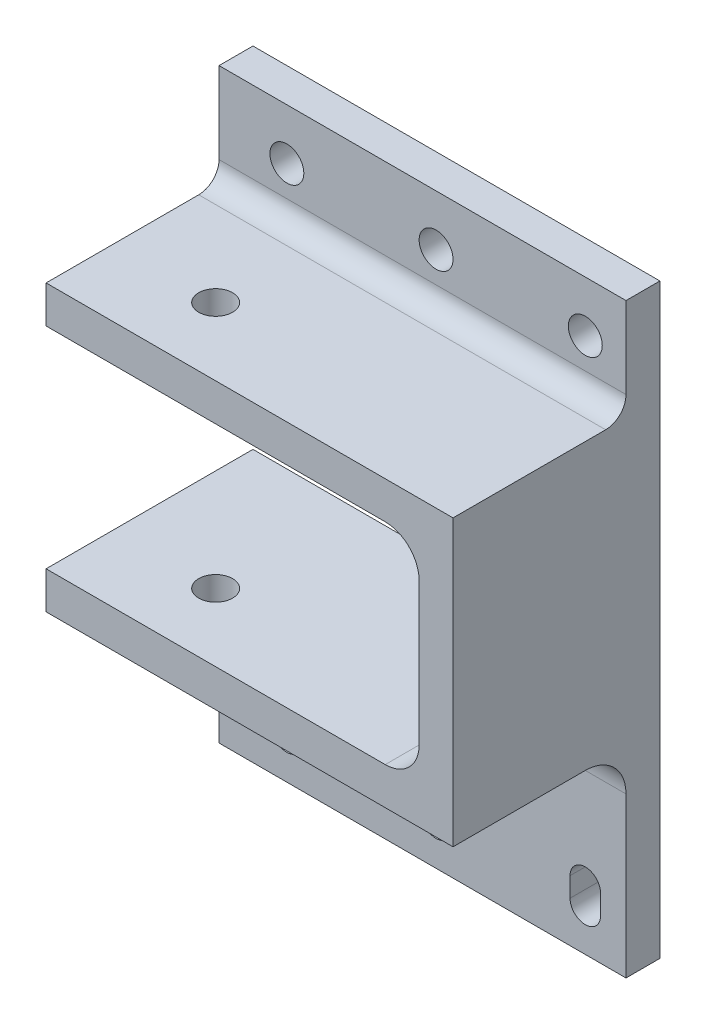
ISO-10303-21;
HEADER;
FILE_DESCRIPTION(('STEP AP214'),'2;1');
FILE_NAME('part.step','',(''),(''),'','','');
FILE_SCHEMA(('AUTOMOTIVE_DESIGN { 1 0 10303 214 1 1 1 1 }'));
ENDSEC;
DATA;
#1=APPLICATION_CONTEXT('core data for automotive mechanical design processes');
#2=APPLICATION_PROTOCOL_DEFINITION('international standard','automotive_design',2000,#1);
#3=PRODUCT_CONTEXT('',#1,'mechanical');
#4=PRODUCT('Part','Part','',(#3));
#5=PRODUCT_RELATED_PRODUCT_CATEGORY('part','',(#4));
#6=PRODUCT_DEFINITION_FORMATION('','',#4);
#7=PRODUCT_DEFINITION_CONTEXT('part definition',#1,'design');
#8=PRODUCT_DEFINITION('design','',#6,#7);
#9=PRODUCT_DEFINITION_SHAPE('','',#8);
#10=(LENGTH_UNIT() NAMED_UNIT(*) SI_UNIT(.MILLI.,.METRE.));
#11=(NAMED_UNIT(*) PLANE_ANGLE_UNIT() SI_UNIT($,.RADIAN.));
#12=(NAMED_UNIT(*) SI_UNIT($,.STERADIAN.) SOLID_ANGLE_UNIT());
#13=UNCERTAINTY_MEASURE_WITH_UNIT(LENGTH_MEASURE(1.E-05),#10,'distance_accuracy_value','');
#14=(GEOMETRIC_REPRESENTATION_CONTEXT(3) GLOBAL_UNCERTAINTY_ASSIGNED_CONTEXT((#13)) GLOBAL_UNIT_ASSIGNED_CONTEXT((#10,
#11,#12)) REPRESENTATION_CONTEXT('',''));
#15=CARTESIAN_POINT('',(0.,0.,0.));
#16=DIRECTION('',(0.,0.,1.));
#17=DIRECTION('',(1.,0.,0.));
#18=AXIS2_PLACEMENT_3D('',#15,#16,#17);
#19=CARTESIAN_POINT('',(0.,42.,0.));
#20=DIRECTION('',(0.,1.,0.));
#21=DIRECTION('',(0.,0.,1.));
#22=AXIS2_PLACEMENT_3D('',#19,#20,#21);
#23=PLANE('',#22);
#24=DIRECTION('',(0.,0.,1.));
#25=VECTOR('',#24,1.);
#26=CARTESIAN_POINT('',(27.5,42.,0.));
#27=LINE('',#26,#25);
#28=CARTESIAN_POINT('',(27.5,42.,-12.5));
#29=VERTEX_POINT('',#28);
#30=CARTESIAN_POINT('',(27.5,42.,10.));
#31=VERTEX_POINT('',#30);
#32=EDGE_CURVE('E214',#29,#31,#27,.T.);
#33=ORIENTED_EDGE('',*,*,#32,.F.);
#34=DIRECTION('',(-1.,0.,0.));
#35=VECTOR('',#34,1.);
#36=CARTESIAN_POINT('',(0.,42.,-12.5));
#37=LINE('',#36,#35);
#38=CARTESIAN_POINT('',(-32.5,42.,-12.5));
#39=VERTEX_POINT('',#38);
#40=EDGE_CURVE('E307',#29,#39,#37,.T.);
#41=ORIENTED_EDGE('',*,*,#40,.T.);
#42=DIRECTION('',(0.,0.,1.));
#43=VECTOR('',#42,1.);
#44=CARTESIAN_POINT('',(-32.5,42.,25.));
#45=LINE('',#44,#43);
#46=CARTESIAN_POINT('',(-32.5,42.,10.));
#47=VERTEX_POINT('',#46);
#48=EDGE_CURVE('E236',#39,#47,#45,.T.);
#49=ORIENTED_EDGE('',*,*,#48,.T.);
#50=DIRECTION('',(-1.,0.,0.));
#51=VECTOR('',#50,1.);
#52=CARTESIAN_POINT('',(-32.5,42.,10.));
#53=LINE('',#52,#51);
#54=EDGE_CURVE('E228',#31,#47,#53,.T.);
#55=ORIENTED_EDGE('',*,*,#54,.F.);
#56=EDGE_LOOP('',(#33,#41,#49,#55));
#57=FACE_BOUND('',#56,.T.);
#58=CARTESIAN_POINT('',(-17.5,42.,0.));
#59=DIRECTION('',(0.,1.,0.));
#60=DIRECTION('',(0.,0.,1.));
#61=AXIS2_PLACEMENT_3D('',#58,#59,#60);
#62=CIRCLE('',#61,2.5);
#63=CARTESIAN_POINT('',(-17.5,42.,2.49999999999999));
#64=VERTEX_POINT('',#63);
#65=EDGE_CURVE('E254',#64,#64,#62,.T.);
#66=ORIENTED_EDGE('',*,*,#65,.F.);
#67=EDGE_LOOP('',(#66));
#68=FACE_BOUND('',#67,.T.);
#69=ADVANCED_FACE('F32',(#57,#68),#23,.T.);
#70=CARTESIAN_POINT('',(-32.5,42.,25.));
#71=DIRECTION('',(1.,0.,0.));
#72=DIRECTION('',(0.,0.,-1.));
#73=AXIS2_PLACEMENT_3D('',#70,#71,#72);
#74=PLANE('',#73);
#75=ORIENTED_EDGE('',*,*,#48,.F.);
#76=CARTESIAN_POINT('',(-32.5,45.,-12.5));
#77=DIRECTION('',(1.,0.,0.));
#78=DIRECTION('',(0.,0.,-1.));
#79=AXIS2_PLACEMENT_3D('',#76,#77,#78);
#80=CIRCLE('',#79,3.);
#81=CARTESIAN_POINT('',(-32.5,45.,-15.5));
#82=VERTEX_POINT('',#81);
#83=EDGE_CURVE('E40',#39,#82,#80,.T.);
#84=ORIENTED_EDGE('',*,*,#83,.T.);
#85=DIRECTION('',(0.,1.,0.));
#86=VECTOR('',#85,1.);
#87=CARTESIAN_POINT('',(-32.5,42.,-15.5));
#88=LINE('',#87,#86);
#89=CARTESIAN_POINT('',(-32.5,57.,-15.5));
#90=VERTEX_POINT('',#89);
#91=EDGE_CURVE('E316',#82,#90,#88,.T.);
#92=ORIENTED_EDGE('',*,*,#91,.T.);
#93=DIRECTION('',(0.,0.,-1.));
#94=VECTOR('',#93,1.);
#95=CARTESIAN_POINT('',(-32.5,57.,-15.5));
#96=LINE('',#95,#94);
#97=CARTESIAN_POINT('',(-32.5,57.,-20.5));
#98=VERTEX_POINT('',#97);
#99=EDGE_CURVE('E395',#90,#98,#96,.T.);
#100=ORIENTED_EDGE('',*,*,#99,.T.);
#101=DIRECTION('',(0.,1.,0.));
#102=VECTOR('',#101,1.);
#103=CARTESIAN_POINT('',(-32.5,-8.,-20.5));
#104=LINE('',#103,#102);
#105=CARTESIAN_POINT('',(-32.5,36.5,-20.5));
#106=VERTEX_POINT('',#105);
#107=EDGE_CURVE('E401',#106,#98,#104,.T.);
#108=ORIENTED_EDGE('',*,*,#107,.F.);
#109=DIRECTION('',(0.,0.,1.));
#110=VECTOR('',#109,1.);
#111=CARTESIAN_POINT('',(-32.5,36.5,25.));
#112=LINE('',#111,#110);
#113=CARTESIAN_POINT('',(-32.5,36.5,10.));
#114=VERTEX_POINT('',#113);
#115=EDGE_CURVE('E267',#106,#114,#112,.T.);
#116=ORIENTED_EDGE('',*,*,#115,.T.);
#117=DIRECTION('',(0.,1.,0.));
#118=VECTOR('',#117,1.);
#119=CARTESIAN_POINT('',(-32.5,-8.,10.));
#120=LINE('',#119,#118);
#121=EDGE_CURVE('E238',#114,#47,#120,.T.);
#122=ORIENTED_EDGE('',*,*,#121,.T.);
#123=EDGE_LOOP('',(#75,#84,#92,#100,#108,#116,#122));
#124=FACE_BOUND('',#123,.T.);
#125=ADVANCED_FACE('F314',(#124),#74,.F.);
#126=DIRECTION('',(0.,0.,-1.));
#127=VECTOR('',#126,1.);
#128=CARTESIAN_POINT('',(-32.5,5.50000000000001,25.));
#129=LINE('',#128,#127);
#130=CARTESIAN_POINT('',(-32.5,5.50000000000001,10.));
#131=VERTEX_POINT('',#130);
#132=CARTESIAN_POINT('',(-32.5,5.50000000000001,-20.5));
#133=VERTEX_POINT('',#132);
#134=EDGE_CURVE('E264',#131,#133,#129,.T.);
#135=ORIENTED_EDGE('',*,*,#134,.T.);
#136=CARTESIAN_POINT('',(-32.5,-29.5,-20.5));
#137=VERTEX_POINT('',#136);
#138=EDGE_CURVE('E402',#137,#133,#104,.T.);
#139=ORIENTED_EDGE('',*,*,#138,.F.);
#140=DIRECTION('',(0.,0.,-1.));
#141=VECTOR('',#140,1.);
#142=CARTESIAN_POINT('',(-32.5,-29.5,-15.5));
#143=LINE('',#142,#141);
#144=CARTESIAN_POINT('',(-32.5,-29.5,-15.5));
#145=VERTEX_POINT('',#144);
#146=EDGE_CURVE('E390',#145,#137,#143,.T.);
#147=ORIENTED_EDGE('',*,*,#146,.F.);
#148=DIRECTION('',(0.,1.,0.));
#149=VECTOR('',#148,1.);
#150=CARTESIAN_POINT('',(-32.5,5.50000000000001,-15.5));
#151=LINE('',#150,#149);
#152=CARTESIAN_POINT('',(-32.5,-6.,-15.5));
#153=VERTEX_POINT('',#152);
#154=EDGE_CURVE('E384',#145,#153,#151,.T.);
#155=ORIENTED_EDGE('',*,*,#154,.T.);
#156=CARTESIAN_POINT('',(-32.5,-6.,-9.49999999999998));
#157=DIRECTION('',(1.,0.,0.));
#158=DIRECTION('',(0.,0.,-1.));
#159=AXIS2_PLACEMENT_3D('',#156,#157,#158);
#160=CIRCLE('',#159,6.);
#161=CARTESIAN_POINT('',(-32.5,0.,-9.49999999999998));
#162=VERTEX_POINT('',#161);
#163=EDGE_CURVE('E305',#153,#162,#160,.T.);
#164=ORIENTED_EDGE('',*,*,#163,.T.);
#165=DIRECTION('',(0.,0.,1.));
#166=VECTOR('',#165,1.);
#167=CARTESIAN_POINT('',(-32.5,0.,25.));
#168=LINE('',#167,#166);
#169=CARTESIAN_POINT('',(-32.5,0.,10.));
#170=VERTEX_POINT('',#169);
#171=EDGE_CURVE('E270',#162,#170,#168,.T.);
#172=ORIENTED_EDGE('',*,*,#171,.T.);
#173=EDGE_CURVE('E241',#170,#131,#120,.T.);
#174=ORIENTED_EDGE('',*,*,#173,.T.);
#175=EDGE_LOOP('',(#135,#139,#147,#155,#164,#172,#174));
#176=FACE_BOUND('',#175,.T.);
#177=ADVANCED_FACE('F344',(#176),#74,.F.);
#178=CARTESIAN_POINT('',(0.,0.,0.));
#179=DIRECTION('',(0.,1.,0.));
#180=DIRECTION('',(0.,0.,1.));
#181=AXIS2_PLACEMENT_3D('',#178,#179,#180);
#182=PLANE('',#181);
#183=CARTESIAN_POINT('',(-17.5,0.,0.));
#184=DIRECTION('',(0.,1.,0.));
#185=DIRECTION('',(0.,0.,1.));
#186=AXIS2_PLACEMENT_3D('',#183,#184,#185);
#187=CIRCLE('',#186,2.5);
#188=CARTESIAN_POINT('',(-17.5,0.,2.49999999999999));
#189=VERTEX_POINT('',#188);
#190=EDGE_CURVE('E261',#189,#189,#187,.T.);
#191=ORIENTED_EDGE('',*,*,#190,.T.);
#192=EDGE_LOOP('',(#191));
#193=FACE_BOUND('',#192,.T.);
#194=DIRECTION('',(1.,0.,0.));
#195=VECTOR('',#194,1.);
#196=CARTESIAN_POINT('',(0.,0.,-9.49999999999998));
#197=LINE('',#196,#195);
#198=CARTESIAN_POINT('',(27.5,0.,-9.49999999999998));
#199=VERTEX_POINT('',#198);
#200=EDGE_CURVE('E300',#162,#199,#197,.T.);
#201=ORIENTED_EDGE('',*,*,#200,.T.);
#202=DIRECTION('',(0.,0.,1.));
#203=VECTOR('',#202,1.);
#204=CARTESIAN_POINT('',(27.5,0.,0.));
#205=LINE('',#204,#203);
#206=CARTESIAN_POINT('',(27.5,0.,10.));
#207=VERTEX_POINT('',#206);
#208=EDGE_CURVE('E423',#199,#207,#205,.T.);
#209=ORIENTED_EDGE('',*,*,#208,.T.);
#210=DIRECTION('',(-1.,0.,0.));
#211=VECTOR('',#210,1.);
#212=CARTESIAN_POINT('',(0.,0.,10.));
#213=LINE('',#212,#211);
#214=EDGE_CURVE('E231',#207,#170,#213,.T.);
#215=ORIENTED_EDGE('',*,*,#214,.T.);
#216=ORIENTED_EDGE('',*,*,#171,.F.);
#217=EDGE_LOOP('',(#201,#209,#215,#216));
#218=FACE_BOUND('',#217,.T.);
#219=ADVANCED_FACE('F350',(#193,#218),#182,.F.);
#220=CARTESIAN_POINT('',(22.5,36.5,-25.));
#221=DIRECTION('',(0.,1.,0.));
#222=DIRECTION('',(-1.,0.,0.));
#223=AXIS2_PLACEMENT_3D('',#220,#221,#222);
#224=PLANE('',#223);
#225=CARTESIAN_POINT('',(-17.5,36.5,0.));
#226=DIRECTION('',(0.,1.,0.));
#227=DIRECTION('',(-1.,0.,0.));
#228=AXIS2_PLACEMENT_3D('',#225,#226,#227);
#229=CIRCLE('',#228,2.5);
#230=CARTESIAN_POINT('',(-20.,36.5,0.));
#231=VERTEX_POINT('',#230);
#232=EDGE_CURVE('E258',#231,#231,#229,.T.);
#233=ORIENTED_EDGE('',*,*,#232,.T.);
#234=EDGE_LOOP('',(#233));
#235=FACE_BOUND('',#234,.T.);
#236=DIRECTION('',(1.,0.,0.));
#237=VECTOR('',#236,1.);
#238=CARTESIAN_POINT('',(22.5,36.5,-20.5));
#239=LINE('',#238,#237);
#240=CARTESIAN_POINT('',(17.5,36.5,-20.5));
#241=VERTEX_POINT('',#240);
#242=EDGE_CURVE('E239',#106,#241,#239,.T.);
#243=ORIENTED_EDGE('',*,*,#242,.T.);
#244=DIRECTION('',(0.,0.,1.));
#245=VECTOR('',#244,1.);
#246=CARTESIAN_POINT('',(17.5,36.5,10.));
#247=LINE('',#246,#245);
#248=CARTESIAN_POINT('',(17.5,36.5,10.));
#249=VERTEX_POINT('',#248);
#250=EDGE_CURVE('E289',#241,#249,#247,.T.);
#251=ORIENTED_EDGE('',*,*,#250,.T.);
#252=DIRECTION('',(-1.,0.,0.));
#253=VECTOR('',#252,1.);
#254=CARTESIAN_POINT('',(22.5,36.5,10.));
#255=LINE('',#254,#253);
#256=EDGE_CURVE('E251',#249,#114,#255,.T.);
#257=ORIENTED_EDGE('',*,*,#256,.T.);
#258=ORIENTED_EDGE('',*,*,#115,.F.);
#259=EDGE_LOOP('',(#243,#251,#257,#258));
#260=FACE_BOUND('',#259,.T.);
#261=ADVANCED_FACE('F352',(#235,#260),#224,.F.);
#262=CARTESIAN_POINT('',(22.5,5.50000000000001,-25.));
#263=DIRECTION('',(0.,-1.,0.));
#264=DIRECTION('',(1.,0.,0.));
#265=AXIS2_PLACEMENT_3D('',#262,#263,#264);
#266=PLANE('',#265);
#267=CARTESIAN_POINT('',(-17.5,5.5,0.));
#268=DIRECTION('',(0.,-1.,0.));
#269=DIRECTION('',(1.,0.,0.));
#270=AXIS2_PLACEMENT_3D('',#267,#268,#269);
#271=CIRCLE('',#270,2.5);
#272=CARTESIAN_POINT('',(-15.,5.5,0.));
#273=VERTEX_POINT('',#272);
#274=EDGE_CURVE('E257',#273,#273,#271,.T.);
#275=ORIENTED_EDGE('',*,*,#274,.T.);
#276=EDGE_LOOP('',(#275));
#277=FACE_BOUND('',#276,.T.);
#278=DIRECTION('',(1.,0.,0.));
#279=VECTOR('',#278,1.);
#280=CARTESIAN_POINT('',(22.5,5.50000000000001,10.));
#281=LINE('',#280,#279);
#282=CARTESIAN_POINT('',(17.5,5.50000000000001,10.));
#283=VERTEX_POINT('',#282);
#284=EDGE_CURVE('E248',#131,#283,#281,.T.);
#285=ORIENTED_EDGE('',*,*,#284,.T.);
#286=DIRECTION('',(0.,0.,1.));
#287=VECTOR('',#286,1.);
#288=CARTESIAN_POINT('',(17.5,5.50000000000001,-20.5));
#289=LINE('',#288,#287);
#290=CARTESIAN_POINT('',(17.5,5.50000000000001,-20.5));
#291=VERTEX_POINT('',#290);
#292=EDGE_CURVE('E287',#283,#291,#289,.F.);
#293=ORIENTED_EDGE('',*,*,#292,.T.);
#294=DIRECTION('',(-1.,0.,0.));
#295=VECTOR('',#294,1.);
#296=CARTESIAN_POINT('',(22.5,5.50000000000001,-20.5));
#297=LINE('',#296,#295);
#298=EDGE_CURVE('E244',#291,#133,#297,.T.);
#299=ORIENTED_EDGE('',*,*,#298,.T.);
#300=ORIENTED_EDGE('',*,*,#134,.F.);
#301=EDGE_LOOP('',(#285,#293,#299,#300));
#302=FACE_BOUND('',#301,.T.);
#303=ADVANCED_FACE('F348',(#277,#302),#266,.F.);
#304=CARTESIAN_POINT('',(22.5,5.50000000000001,-25.));
#305=DIRECTION('',(1.,0.,0.));
#306=DIRECTION('',(0.,0.,-1.));
#307=AXIS2_PLACEMENT_3D('',#304,#305,#306);
#308=PLANE('',#307);
#309=DIRECTION('',(0.,-1.,0.));
#310=VECTOR('',#309,1.);
#311=CARTESIAN_POINT('',(22.5,5.50000000000001,-20.5));
#312=LINE('',#311,#310);
#313=CARTESIAN_POINT('',(22.5,31.5,-20.5));
#314=VERTEX_POINT('',#313);
#315=CARTESIAN_POINT('',(22.5,10.5,-20.5));
#316=VERTEX_POINT('',#315);
#317=EDGE_CURVE('E279',#314,#316,#312,.T.);
#318=ORIENTED_EDGE('',*,*,#317,.T.);
#319=DIRECTION('',(0.,0.,1.));
#320=VECTOR('',#319,1.);
#321=CARTESIAN_POINT('',(22.5,10.5,10.));
#322=LINE('',#321,#320);
#323=CARTESIAN_POINT('',(22.5,10.5,10.));
#324=VERTEX_POINT('',#323);
#325=EDGE_CURVE('E284',#316,#324,#322,.T.);
#326=ORIENTED_EDGE('',*,*,#325,.T.);
#327=DIRECTION('',(0.,1.,0.));
#328=VECTOR('',#327,1.);
#329=CARTESIAN_POINT('',(22.5,5.50000000000001,10.));
#330=LINE('',#329,#328);
#331=CARTESIAN_POINT('',(22.5,31.5,10.));
#332=VERTEX_POINT('',#331);
#333=EDGE_CURVE('E272',#324,#332,#330,.T.);
#334=ORIENTED_EDGE('',*,*,#333,.T.);
#335=DIRECTION('',(0.,0.,1.));
#336=VECTOR('',#335,1.);
#337=CARTESIAN_POINT('',(22.5,31.5,-20.5));
#338=LINE('',#337,#336);
#339=EDGE_CURVE('E282',#332,#314,#338,.F.);
#340=ORIENTED_EDGE('',*,*,#339,.T.);
#341=EDGE_LOOP('',(#318,#326,#334,#340));
#342=FACE_BOUND('',#341,.T.);
#343=ADVANCED_FACE('F549',(#342),#308,.F.);
#344=CARTESIAN_POINT('',(-17.5,-8.,0.));
#345=DIRECTION('',(0.,1.,0.));
#346=DIRECTION('',(0.,0.,1.));
#347=AXIS2_PLACEMENT_3D('',#344,#345,#346);
#348=CYLINDRICAL_SURFACE('',#347,2.5);
#349=ORIENTED_EDGE('',*,*,#274,.F.);
#350=EDGE_LOOP('',(#349));
#351=FACE_BOUND('',#350,.T.);
#352=ORIENTED_EDGE('',*,*,#190,.F.);
#353=EDGE_LOOP('',(#352));
#354=FACE_BOUND('',#353,.T.);
#355=ADVANCED_FACE('F560',(#351,#354),#348,.F.);
#356=ORIENTED_EDGE('',*,*,#65,.T.);
#357=EDGE_LOOP('',(#356));
#358=FACE_BOUND('',#357,.T.);
#359=ORIENTED_EDGE('',*,*,#232,.F.);
#360=EDGE_LOOP('',(#359));
#361=FACE_BOUND('',#360,.T.);
#362=ADVANCED_FACE('F567',(#358,#361),#348,.F.);
#363=CARTESIAN_POINT('',(-32.5,-8.,10.));
#364=DIRECTION('',(0.,0.,-1.));
#365=DIRECTION('',(-1.,0.,0.));
#366=AXIS2_PLACEMENT_3D('',#363,#364,#365);
#367=PLANE('',#366);
#368=ORIENTED_EDGE('',*,*,#214,.F.);
#369=DIRECTION('',(0.,-1.,0.));
#370=VECTOR('',#369,1.);
#371=CARTESIAN_POINT('',(27.5,57.,10.));
#372=LINE('',#371,#370);
#373=EDGE_CURVE('E217',#31,#207,#372,.T.);
#374=ORIENTED_EDGE('',*,*,#373,.F.);
#375=ORIENTED_EDGE('',*,*,#54,.T.);
#376=ORIENTED_EDGE('',*,*,#121,.F.);
#377=ORIENTED_EDGE('',*,*,#256,.F.);
#378=CARTESIAN_POINT('',(17.5,31.5,10.));
#379=DIRECTION('',(0.,0.,-1.));
#380=DIRECTION('',(-1.,0.,0.));
#381=AXIS2_PLACEMENT_3D('',#378,#379,#380);
#382=CIRCLE('',#381,5.);
#383=EDGE_CURVE('E296',#249,#332,#382,.T.);
#384=ORIENTED_EDGE('',*,*,#383,.T.);
#385=ORIENTED_EDGE('',*,*,#333,.F.);
#386=CARTESIAN_POINT('',(17.5,10.5,10.));
#387=DIRECTION('',(0.,0.,-1.));
#388=DIRECTION('',(-1.,0.,0.));
#389=AXIS2_PLACEMENT_3D('',#386,#387,#388);
#390=CIRCLE('',#389,5.);
#391=EDGE_CURVE('E292',#324,#283,#390,.T.);
#392=ORIENTED_EDGE('',*,*,#391,.T.);
#393=ORIENTED_EDGE('',*,*,#284,.F.);
#394=ORIENTED_EDGE('',*,*,#173,.F.);
#395=EDGE_LOOP('',(#368,#374,#375,#376,#377,#384,#385,#392,#393,#394));
#396=FACE_BOUND('',#395,.T.);
#397=ADVANCED_FACE('F226',(#396),#367,.F.);
#398=CARTESIAN_POINT('',(-32.5,-8.,-20.5));
#399=DIRECTION('',(0.,0.,1.));
#400=DIRECTION('',(1.,0.,0.));
#401=AXIS2_PLACEMENT_3D('',#398,#399,#400);
#402=PLANE('',#401);
#403=DIRECTION('',(0.,-1.,0.));
#404=VECTOR('',#403,1.);
#405=CARTESIAN_POINT('',(-24.75,-23.4400087527315,-20.5));
#406=LINE('',#405,#404);
#407=CARTESIAN_POINT('',(-24.75,-20.5599912472686,-20.5));
#408=VERTEX_POINT('',#407);
#409=CARTESIAN_POINT('',(-24.75,-23.4400087527315,-20.5));
#410=VERTEX_POINT('',#409);
#411=EDGE_CURVE('E436',#408,#410,#406,.T.);
#412=ORIENTED_EDGE('',*,*,#411,.T.);
#413=CARTESIAN_POINT('',(-22.5,-23.4400087527315,-20.5));
#414=DIRECTION('',(0.,0.,1.));
#415=DIRECTION('',(1.,0.,0.));
#416=AXIS2_PLACEMENT_3D('',#413,#414,#415);
#417=CIRCLE('',#416,2.25);
#418=CARTESIAN_POINT('',(-20.25,-23.4400087527315,-20.5));
#419=VERTEX_POINT('',#418);
#420=EDGE_CURVE('E428',#410,#419,#417,.T.);
#421=ORIENTED_EDGE('',*,*,#420,.T.);
#422=DIRECTION('',(0.,1.,0.));
#423=VECTOR('',#422,1.);
#424=CARTESIAN_POINT('',(-20.25,-23.4400087527315,-20.5));
#425=LINE('',#424,#423);
#426=CARTESIAN_POINT('',(-20.25,-20.5599912472686,-20.5));
#427=VERTEX_POINT('',#426);
#428=EDGE_CURVE('E431',#419,#427,#425,.T.);
#429=ORIENTED_EDGE('',*,*,#428,.T.);
#430=CARTESIAN_POINT('',(-22.5,-20.5599912472686,-20.5));
#431=DIRECTION('',(0.,0.,1.));
#432=DIRECTION('',(1.,0.,0.));
#433=AXIS2_PLACEMENT_3D('',#430,#431,#432);
#434=CIRCLE('',#433,2.25);
#435=EDGE_CURVE('E54',#427,#408,#434,.T.);
#436=ORIENTED_EDGE('',*,*,#435,.T.);
#437=EDGE_LOOP('',(#412,#421,#429,#436));
#438=FACE_BOUND('',#437,.T.);
#439=DIRECTION('',(0.,-1.,0.));
#440=VECTOR('',#439,1.);
#441=CARTESIAN_POINT('',(-2.74999999999998,-23.4400087527315,-20.5));
#442=LINE('',#441,#440);
#443=CARTESIAN_POINT('',(-2.74999999999998,-20.5599912472686,-20.5));
#444=VERTEX_POINT('',#443);
#445=CARTESIAN_POINT('',(-2.74999999999998,-23.4400087527315,-20.5));
#446=VERTEX_POINT('',#445);
#447=EDGE_CURVE('E470',#444,#446,#442,.T.);
#448=ORIENTED_EDGE('',*,*,#447,.T.);
#449=CARTESIAN_POINT('',(-0.499999999999987,-23.4400087527315,-20.5));
#450=DIRECTION('',(0.,0.,1.));
#451=DIRECTION('',(1.,0.,0.));
#452=AXIS2_PLACEMENT_3D('',#449,#450,#451);
#453=CIRCLE('',#452,2.25);
#454=CARTESIAN_POINT('',(1.75000000000001,-23.4400087527315,-20.5));
#455=VERTEX_POINT('',#454);
#456=EDGE_CURVE('E460',#446,#455,#453,.T.);
#457=ORIENTED_EDGE('',*,*,#456,.T.);
#458=DIRECTION('',(0.,1.,0.));
#459=VECTOR('',#458,1.);
#460=CARTESIAN_POINT('',(1.75000000000001,-23.4400087527315,-20.5));
#461=LINE('',#460,#459);
#462=CARTESIAN_POINT('',(1.75000000000002,-20.5599912472686,-20.5));
#463=VERTEX_POINT('',#462);
#464=EDGE_CURVE('E463',#455,#463,#461,.T.);
#465=ORIENTED_EDGE('',*,*,#464,.T.);
#466=CARTESIAN_POINT('',(-0.499999999999987,-20.5599912472686,-20.5));
#467=DIRECTION('',(0.,0.,1.));
#468=DIRECTION('',(1.,0.,0.));
#469=AXIS2_PLACEMENT_3D('',#466,#467,#468);
#470=CIRCLE('',#469,2.25);
#471=EDGE_CURVE('E467',#463,#444,#470,.T.);
#472=ORIENTED_EDGE('',*,*,#471,.T.);
#473=EDGE_LOOP('',(#448,#457,#465,#472));
#474=FACE_BOUND('',#473,.T.);
#475=DIRECTION('',(0.,-1.,0.));
#476=VECTOR('',#475,1.);
#477=CARTESIAN_POINT('',(19.25,-23.4400087527315,-20.5));
#478=LINE('',#477,#476);
#479=CARTESIAN_POINT('',(19.25,-20.5599912472686,-20.5));
#480=VERTEX_POINT('',#479);
#481=CARTESIAN_POINT('',(19.25,-23.4400087527315,-20.5));
#482=VERTEX_POINT('',#481);
#483=EDGE_CURVE('E502',#480,#482,#478,.T.);
#484=ORIENTED_EDGE('',*,*,#483,.T.);
#485=CARTESIAN_POINT('',(21.5,-23.4400087527315,-20.5));
#486=DIRECTION('',(0.,0.,1.));
#487=DIRECTION('',(1.,0.,0.));
#488=AXIS2_PLACEMENT_3D('',#485,#486,#487);
#489=CIRCLE('',#488,2.25);
#490=CARTESIAN_POINT('',(23.75,-23.4400087527315,-20.5));
#491=VERTEX_POINT('',#490);
#492=EDGE_CURVE('E492',#482,#491,#489,.T.);
#493=ORIENTED_EDGE('',*,*,#492,.T.);
#494=DIRECTION('',(0.,1.,0.));
#495=VECTOR('',#494,1.);
#496=CARTESIAN_POINT('',(23.75,-23.4400087527315,-20.5));
#497=LINE('',#496,#495);
#498=CARTESIAN_POINT('',(23.75,-20.5599912472686,-20.5));
#499=VERTEX_POINT('',#498);
#500=EDGE_CURVE('E495',#491,#499,#497,.T.);
#501=ORIENTED_EDGE('',*,*,#500,.T.);
#502=CARTESIAN_POINT('',(21.5,-20.5599912472686,-20.5));
#503=DIRECTION('',(0.,0.,1.));
#504=DIRECTION('',(1.,0.,0.));
#505=AXIS2_PLACEMENT_3D('',#502,#503,#504);
#506=CIRCLE('',#505,2.25);
#507=EDGE_CURVE('E499',#499,#480,#506,.T.);
#508=ORIENTED_EDGE('',*,*,#507,.T.);
#509=EDGE_LOOP('',(#484,#493,#501,#508));
#510=FACE_BOUND('',#509,.T.);
#511=CARTESIAN_POINT('',(-22.5,49.5,-20.5));
#512=DIRECTION('',(0.,0.,1.));
#513=DIRECTION('',(1.,0.,0.));
#514=AXIS2_PLACEMENT_3D('',#511,#512,#513);
#515=CIRCLE('',#514,2.5);
#516=CARTESIAN_POINT('',(-20.,49.5,-20.5));
#517=VERTEX_POINT('',#516);
#518=EDGE_CURVE('E522',#517,#517,#515,.T.);
#519=ORIENTED_EDGE('',*,*,#518,.T.);
#520=EDGE_LOOP('',(#519));
#521=FACE_BOUND('',#520,.T.);
#522=CARTESIAN_POINT('',(-0.499999999999987,49.5,-20.5));
#523=DIRECTION('',(0.,0.,1.));
#524=DIRECTION('',(1.,0.,0.));
#525=AXIS2_PLACEMENT_3D('',#522,#523,#524);
#526=CIRCLE('',#525,2.5);
#527=CARTESIAN_POINT('',(2.00000000000001,49.5,-20.5));
#528=VERTEX_POINT('',#527);
#529=EDGE_CURVE('E528',#528,#528,#526,.T.);
#530=ORIENTED_EDGE('',*,*,#529,.T.);
#531=EDGE_LOOP('',(#530));
#532=FACE_BOUND('',#531,.T.);
#533=CARTESIAN_POINT('',(21.5,49.5,-20.5));
#534=DIRECTION('',(0.,0.,1.));
#535=DIRECTION('',(1.,0.,0.));
#536=AXIS2_PLACEMENT_3D('',#533,#534,#535);
#537=CIRCLE('',#536,2.5);
#538=CARTESIAN_POINT('',(24.,49.5,-20.5));
#539=VERTEX_POINT('',#538);
#540=EDGE_CURVE('E534',#539,#539,#537,.T.);
#541=ORIENTED_EDGE('',*,*,#540,.T.);
#542=EDGE_LOOP('',(#541));
#543=FACE_BOUND('',#542,.T.);
#544=DIRECTION('',(1.,0.,0.));
#545=VECTOR('',#544,1.);
#546=CARTESIAN_POINT('',(-32.5,57.,-20.5));
#547=LINE('',#546,#545);
#548=CARTESIAN_POINT('',(27.5,57.,-20.5));
#549=VERTEX_POINT('',#548);
#550=EDGE_CURVE('E325',#98,#549,#547,.T.);
#551=ORIENTED_EDGE('',*,*,#550,.T.);
#552=DIRECTION('',(0.,-1.,0.));
#553=VECTOR('',#552,1.);
#554=CARTESIAN_POINT('',(27.5,-7.99999999999999,-20.5));
#555=LINE('',#554,#553);
#556=CARTESIAN_POINT('',(27.5,-29.5,-20.5));
#557=VERTEX_POINT('',#556);
#558=EDGE_CURVE('E425',#549,#557,#555,.T.);
#559=ORIENTED_EDGE('',*,*,#558,.T.);
#560=DIRECTION('',(-1.,0.,0.));
#561=VECTOR('',#560,1.);
#562=CARTESIAN_POINT('',(-32.5,-29.5,-20.5));
#563=LINE('',#562,#561);
#564=EDGE_CURVE('E392',#557,#137,#563,.T.);
#565=ORIENTED_EDGE('',*,*,#564,.T.);
#566=ORIENTED_EDGE('',*,*,#138,.T.);
#567=ORIENTED_EDGE('',*,*,#298,.F.);
#568=CARTESIAN_POINT('',(17.5,10.5,-20.5));
#569=DIRECTION('',(0.,0.,1.));
#570=DIRECTION('',(1.,0.,0.));
#571=AXIS2_PLACEMENT_3D('',#568,#569,#570);
#572=CIRCLE('',#571,5.);
#573=EDGE_CURVE('E294',#291,#316,#572,.T.);
#574=ORIENTED_EDGE('',*,*,#573,.T.);
#575=ORIENTED_EDGE('',*,*,#317,.F.);
#576=CARTESIAN_POINT('',(17.5,31.5,-20.5));
#577=DIRECTION('',(0.,0.,1.));
#578=DIRECTION('',(1.,0.,0.));
#579=AXIS2_PLACEMENT_3D('',#576,#577,#578);
#580=CIRCLE('',#579,5.);
#581=EDGE_CURVE('E298',#314,#241,#580,.T.);
#582=ORIENTED_EDGE('',*,*,#581,.T.);
#583=ORIENTED_EDGE('',*,*,#242,.F.);
#584=ORIENTED_EDGE('',*,*,#107,.T.);
#585=EDGE_LOOP('',(#551,#559,#565,#566,#567,#574,#575,#582,#583,#584));
#586=FACE_BOUND('',#585,.T.);
#587=ADVANCED_FACE('F409',(#438,#474,#510,#521,#532,#543,#586),#402,.F.);
#588=CARTESIAN_POINT('',(0.,0.,-15.5));
#589=DIRECTION('',(0.,0.,1.));
#590=DIRECTION('',(1.,0.,0.));
#591=AXIS2_PLACEMENT_3D('',#588,#589,#590);
#592=PLANE('',#591);
#593=DIRECTION('',(0.,-1.,0.));
#594=VECTOR('',#593,1.);
#595=CARTESIAN_POINT('',(27.5,0.,-15.5));
#596=LINE('',#595,#594);
#597=CARTESIAN_POINT('',(27.5,-6.,-15.5));
#598=VERTEX_POINT('',#597);
#599=CARTESIAN_POINT('',(27.5,-29.5,-15.5));
#600=VERTEX_POINT('',#599);
#601=EDGE_CURVE('E385',#598,#600,#596,.T.);
#602=ORIENTED_EDGE('',*,*,#601,.F.);
#603=DIRECTION('',(1.,0.,0.));
#604=VECTOR('',#603,1.);
#605=CARTESIAN_POINT('',(0.,-6.,-15.5));
#606=LINE('',#605,#604);
#607=EDGE_CURVE('E303',#598,#153,#606,.F.);
#608=ORIENTED_EDGE('',*,*,#607,.T.);
#609=ORIENTED_EDGE('',*,*,#154,.F.);
#610=DIRECTION('',(-1.,0.,0.));
#611=VECTOR('',#610,1.);
#612=CARTESIAN_POINT('',(-32.5,-29.5,-15.5));
#613=LINE('',#612,#611);
#614=EDGE_CURVE('E391',#600,#145,#613,.T.);
#615=ORIENTED_EDGE('',*,*,#614,.F.);
#616=EDGE_LOOP('',(#602,#608,#609,#615));
#617=FACE_BOUND('',#616,.T.);
#618=CARTESIAN_POINT('',(-22.5,-23.4400087527315,-15.5));
#619=DIRECTION('',(0.,0.,1.));
#620=DIRECTION('',(1.,0.,0.));
#621=AXIS2_PLACEMENT_3D('',#618,#619,#620);
#622=CIRCLE('',#621,2.25);
#623=CARTESIAN_POINT('',(-24.75,-23.4400087527315,-15.5));
#624=VERTEX_POINT('',#623);
#625=CARTESIAN_POINT('',(-20.25,-23.4400087527315,-15.5));
#626=VERTEX_POINT('',#625);
#627=EDGE_CURVE('E440',#624,#626,#622,.T.);
#628=ORIENTED_EDGE('',*,*,#627,.F.);
#629=DIRECTION('',(0.,-1.,0.));
#630=VECTOR('',#629,1.);
#631=CARTESIAN_POINT('',(-24.75,-23.4400087527315,-15.5));
#632=LINE('',#631,#630);
#633=CARTESIAN_POINT('',(-24.75,-20.5599912472686,-15.5));
#634=VERTEX_POINT('',#633);
#635=EDGE_CURVE('E432',#634,#624,#632,.T.);
#636=ORIENTED_EDGE('',*,*,#635,.F.);
#637=CARTESIAN_POINT('',(-22.5,-20.5599912472686,-15.5));
#638=DIRECTION('',(0.,0.,1.));
#639=DIRECTION('',(1.,0.,0.));
#640=AXIS2_PLACEMENT_3D('',#637,#638,#639);
#641=CIRCLE('',#640,2.25);
#642=CARTESIAN_POINT('',(-20.25,-20.5599912472686,-15.5));
#643=VERTEX_POINT('',#642);
#644=EDGE_CURVE('E446',#643,#634,#641,.T.);
#645=ORIENTED_EDGE('',*,*,#644,.F.);
#646=DIRECTION('',(0.,1.,0.));
#647=VECTOR('',#646,1.);
#648=CARTESIAN_POINT('',(-20.25,-23.4400087527315,-15.5));
#649=LINE('',#648,#647);
#650=EDGE_CURVE('E442',#626,#643,#649,.T.);
#651=ORIENTED_EDGE('',*,*,#650,.F.);
#652=EDGE_LOOP('',(#628,#636,#645,#651));
#653=FACE_BOUND('',#652,.T.);
#654=CARTESIAN_POINT('',(-0.499999999999987,-23.4400087527315,-15.5));
#655=DIRECTION('',(0.,0.,1.));
#656=DIRECTION('',(1.,0.,0.));
#657=AXIS2_PLACEMENT_3D('',#654,#655,#656);
#658=CIRCLE('',#657,2.25);
#659=CARTESIAN_POINT('',(-2.74999999999998,-23.4400087527315,-15.5));
#660=VERTEX_POINT('',#659);
#661=CARTESIAN_POINT('',(1.75000000000001,-23.4400087527315,-15.5));
#662=VERTEX_POINT('',#661);
#663=EDGE_CURVE('E474',#660,#662,#658,.T.);
#664=ORIENTED_EDGE('',*,*,#663,.F.);
#665=DIRECTION('',(0.,-1.,0.));
#666=VECTOR('',#665,1.);
#667=CARTESIAN_POINT('',(-2.74999999999998,-23.4400087527315,-15.5));
#668=LINE('',#667,#666);
#669=CARTESIAN_POINT('',(-2.74999999999998,-20.5599912472686,-15.5));
#670=VERTEX_POINT('',#669);
#671=EDGE_CURVE('E464',#670,#660,#668,.T.);
#672=ORIENTED_EDGE('',*,*,#671,.F.);
#673=CARTESIAN_POINT('',(-0.499999999999987,-20.5599912472686,-15.5));
#674=DIRECTION('',(0.,0.,1.));
#675=DIRECTION('',(1.,0.,0.));
#676=AXIS2_PLACEMENT_3D('',#673,#674,#675);
#677=CIRCLE('',#676,2.25);
#678=CARTESIAN_POINT('',(1.75000000000001,-20.5599912472686,-15.5));
#679=VERTEX_POINT('',#678);
#680=EDGE_CURVE('E480',#679,#670,#677,.T.);
#681=ORIENTED_EDGE('',*,*,#680,.F.);
#682=DIRECTION('',(0.,1.,0.));
#683=VECTOR('',#682,1.);
#684=CARTESIAN_POINT('',(1.75000000000001,-23.4400087527315,-15.5));
#685=LINE('',#684,#683);
#686=EDGE_CURVE('E476',#662,#679,#685,.T.);
#687=ORIENTED_EDGE('',*,*,#686,.F.);
#688=EDGE_LOOP('',(#664,#672,#681,#687));
#689=FACE_BOUND('',#688,.T.);
#690=CARTESIAN_POINT('',(21.5,-23.4400087527315,-15.5));
#691=DIRECTION('',(0.,0.,1.));
#692=DIRECTION('',(1.,0.,0.));
#693=AXIS2_PLACEMENT_3D('',#690,#691,#692);
#694=CIRCLE('',#693,2.25);
#695=CARTESIAN_POINT('',(19.25,-23.4400087527315,-15.5));
#696=VERTEX_POINT('',#695);
#697=CARTESIAN_POINT('',(23.75,-23.4400087527315,-15.5));
#698=VERTEX_POINT('',#697);
#699=EDGE_CURVE('E427',#696,#698,#694,.T.);
#700=ORIENTED_EDGE('',*,*,#699,.F.);
#701=DIRECTION('',(0.,-1.,0.));
#702=VECTOR('',#701,1.);
#703=CARTESIAN_POINT('',(19.25,-23.4400087527315,-15.5));
#704=LINE('',#703,#702);
#705=CARTESIAN_POINT('',(19.25,-20.5599912472686,-15.5));
#706=VERTEX_POINT('',#705);
#707=EDGE_CURVE('E496',#706,#696,#704,.T.);
#708=ORIENTED_EDGE('',*,*,#707,.F.);
#709=CARTESIAN_POINT('',(21.5,-20.5599912472686,-15.5));
#710=DIRECTION('',(0.,0.,1.));
#711=DIRECTION('',(1.,0.,0.));
#712=AXIS2_PLACEMENT_3D('',#709,#710,#711);
#713=CIRCLE('',#712,2.25);
#714=CARTESIAN_POINT('',(23.75,-20.5599912472686,-15.5));
#715=VERTEX_POINT('',#714);
#716=EDGE_CURVE('E510',#715,#706,#713,.T.);
#717=ORIENTED_EDGE('',*,*,#716,.F.);
#718=DIRECTION('',(0.,1.,0.));
#719=VECTOR('',#718,1.);
#720=CARTESIAN_POINT('',(23.75,-23.4400087527315,-15.5));
#721=LINE('',#720,#719);
#722=EDGE_CURVE('E507',#698,#715,#721,.T.);
#723=ORIENTED_EDGE('',*,*,#722,.F.);
#724=EDGE_LOOP('',(#700,#708,#717,#723));
#725=FACE_BOUND('',#724,.T.);
#726=ADVANCED_FACE('F381',(#617,#653,#689,#725),#592,.T.);
#727=CARTESIAN_POINT('',(-32.5,-29.5,-15.5));
#728=DIRECTION('',(0.,-1.,0.));
#729=DIRECTION('',(1.,0.,0.));
#730=AXIS2_PLACEMENT_3D('',#727,#728,#729);
#731=PLANE('',#730);
#732=DIRECTION('',(0.,0.,1.));
#733=VECTOR('',#732,1.);
#734=CARTESIAN_POINT('',(27.5,-29.5,-61.));
#735=LINE('',#734,#733);
#736=EDGE_CURVE('E416',#557,#600,#735,.T.);
#737=ORIENTED_EDGE('',*,*,#736,.T.);
#738=ORIENTED_EDGE('',*,*,#614,.T.);
#739=ORIENTED_EDGE('',*,*,#146,.T.);
#740=ORIENTED_EDGE('',*,*,#564,.F.);
#741=EDGE_LOOP('',(#737,#738,#739,#740));
#742=FACE_BOUND('',#741,.T.);
#743=ADVANCED_FACE('F361',(#742),#731,.T.);
#744=CARTESIAN_POINT('',(17.5,10.5,-25.));
#745=DIRECTION('',(0.,0.,-1.));
#746=DIRECTION('',(-1.,0.,0.));
#747=AXIS2_PLACEMENT_3D('',#744,#745,#746);
#748=CYLINDRICAL_SURFACE('',#747,5.);
#749=ORIENTED_EDGE('',*,*,#573,.F.);
#750=ORIENTED_EDGE('',*,*,#292,.F.);
#751=ORIENTED_EDGE('',*,*,#391,.F.);
#752=ORIENTED_EDGE('',*,*,#325,.F.);
#753=EDGE_LOOP('',(#749,#750,#751,#752));
#754=FACE_BOUND('',#753,.T.);
#755=ADVANCED_FACE('F357',(#754),#748,.F.);
#756=CARTESIAN_POINT('',(17.5,31.5,-25.));
#757=DIRECTION('',(0.,0.,-1.));
#758=DIRECTION('',(-1.,0.,0.));
#759=AXIS2_PLACEMENT_3D('',#756,#757,#758);
#760=CYLINDRICAL_SURFACE('',#759,5.);
#761=ORIENTED_EDGE('',*,*,#581,.F.);
#762=ORIENTED_EDGE('',*,*,#339,.F.);
#763=ORIENTED_EDGE('',*,*,#383,.F.);
#764=ORIENTED_EDGE('',*,*,#250,.F.);
#765=EDGE_LOOP('',(#761,#762,#763,#764));
#766=FACE_BOUND('',#765,.T.);
#767=ADVANCED_FACE('F360',(#766),#760,.F.);
#768=CARTESIAN_POINT('',(0.,-6.,-9.49999999999998));
#769=DIRECTION('',(1.,0.,0.));
#770=DIRECTION('',(0.,0.,-1.));
#771=AXIS2_PLACEMENT_3D('',#768,#769,#770);
#772=CYLINDRICAL_SURFACE('',#771,6.);
#773=ORIENTED_EDGE('',*,*,#607,.F.);
#774=CARTESIAN_POINT('',(27.5,-6.,-9.49999999999998));
#775=DIRECTION('',(-1.,0.,0.));
#776=DIRECTION('',(0.,-1.,0.));
#777=AXIS2_PLACEMENT_3D('',#774,#775,#776);
#778=CIRCLE('',#777,6.);
#779=EDGE_CURVE('E222',#598,#199,#778,.F.);
#780=ORIENTED_EDGE('',*,*,#779,.T.);
#781=ORIENTED_EDGE('',*,*,#200,.F.);
#782=ORIENTED_EDGE('',*,*,#163,.F.);
#783=EDGE_LOOP('',(#773,#780,#781,#782));
#784=FACE_BOUND('',#783,.T.);
#785=ADVANCED_FACE('F364',(#784),#772,.F.);
#786=CARTESIAN_POINT('',(-32.5,57.,-15.5));
#787=DIRECTION('',(0.,1.,0.));
#788=DIRECTION('',(0.,0.,1.));
#789=AXIS2_PLACEMENT_3D('',#786,#787,#788);
#790=PLANE('',#789);
#791=DIRECTION('',(0.,0.,1.));
#792=VECTOR('',#791,1.);
#793=CARTESIAN_POINT('',(27.5,57.,-61.));
#794=LINE('',#793,#792);
#795=CARTESIAN_POINT('',(27.5,57.,-15.5));
#796=VERTEX_POINT('',#795);
#797=EDGE_CURVE('E232',#549,#796,#794,.T.);
#798=ORIENTED_EDGE('',*,*,#797,.F.);
#799=ORIENTED_EDGE('',*,*,#550,.F.);
#800=ORIENTED_EDGE('',*,*,#99,.F.);
#801=DIRECTION('',(1.,0.,0.));
#802=VECTOR('',#801,1.);
#803=CARTESIAN_POINT('',(-32.5,57.,-15.5));
#804=LINE('',#803,#802);
#805=EDGE_CURVE('E324',#90,#796,#804,.T.);
#806=ORIENTED_EDGE('',*,*,#805,.T.);
#807=EDGE_LOOP('',(#798,#799,#800,#806));
#808=FACE_BOUND('',#807,.T.);
#809=ADVANCED_FACE('F336',(#808),#790,.T.);
#810=CARTESIAN_POINT('',(0.,0.,-15.5));
#811=DIRECTION('',(0.,0.,-1.));
#812=DIRECTION('',(-1.,0.,0.));
#813=AXIS2_PLACEMENT_3D('',#810,#811,#812);
#814=PLANE('',#813);
#815=CARTESIAN_POINT('',(-22.5,49.5,-15.5));
#816=DIRECTION('',(0.,0.,1.));
#817=DIRECTION('',(1.,0.,0.));
#818=AXIS2_PLACEMENT_3D('',#815,#816,#817);
#819=CIRCLE('',#818,2.5);
#820=CARTESIAN_POINT('',(-20.,49.5,-15.5));
#821=VERTEX_POINT('',#820);
#822=EDGE_CURVE('E525',#821,#821,#819,.T.);
#823=ORIENTED_EDGE('',*,*,#822,.F.);
#824=EDGE_LOOP('',(#823));
#825=FACE_BOUND('',#824,.T.);
#826=CARTESIAN_POINT('',(-0.499999999999987,49.5,-15.5));
#827=DIRECTION('',(0.,0.,1.));
#828=DIRECTION('',(1.,0.,0.));
#829=AXIS2_PLACEMENT_3D('',#826,#827,#828);
#830=CIRCLE('',#829,2.5);
#831=CARTESIAN_POINT('',(2.00000000000001,49.5,-15.5));
#832=VERTEX_POINT('',#831);
#833=EDGE_CURVE('E531',#832,#832,#830,.T.);
#834=ORIENTED_EDGE('',*,*,#833,.F.);
#835=EDGE_LOOP('',(#834));
#836=FACE_BOUND('',#835,.T.);
#837=CARTESIAN_POINT('',(21.5,49.5,-15.5));
#838=DIRECTION('',(0.,0.,1.));
#839=DIRECTION('',(1.,0.,0.));
#840=AXIS2_PLACEMENT_3D('',#837,#838,#839);
#841=CIRCLE('',#840,2.5);
#842=CARTESIAN_POINT('',(24.,49.5,-15.5));
#843=VERTEX_POINT('',#842);
#844=EDGE_CURVE('E453',#843,#843,#841,.T.);
#845=ORIENTED_EDGE('',*,*,#844,.F.);
#846=EDGE_LOOP('',(#845));
#847=FACE_BOUND('',#846,.T.);
#848=DIRECTION('',(-1.,0.,0.));
#849=VECTOR('',#848,1.);
#850=CARTESIAN_POINT('',(0.,45.,-15.5));
#851=LINE('',#850,#849);
#852=CARTESIAN_POINT('',(27.5,45.,-15.5));
#853=VERTEX_POINT('',#852);
#854=EDGE_CURVE('E309',#82,#853,#851,.F.);
#855=ORIENTED_EDGE('',*,*,#854,.T.);
#856=DIRECTION('',(0.,1.,0.));
#857=VECTOR('',#856,1.);
#858=CARTESIAN_POINT('',(27.5,0.,-15.5));
#859=LINE('',#858,#857);
#860=EDGE_CURVE('E47',#853,#796,#859,.T.);
#861=ORIENTED_EDGE('',*,*,#860,.T.);
#862=ORIENTED_EDGE('',*,*,#805,.F.);
#863=ORIENTED_EDGE('',*,*,#91,.F.);
#864=EDGE_LOOP('',(#855,#861,#862,#863));
#865=FACE_BOUND('',#864,.T.);
#866=ADVANCED_FACE('F322',(#825,#836,#847,#865),#814,.F.);
#867=CARTESIAN_POINT('',(0.,45.,-12.5));
#868=DIRECTION('',(-1.,0.,0.));
#869=DIRECTION('',(0.,0.,1.));
#870=AXIS2_PLACEMENT_3D('',#867,#868,#869);
#871=CYLINDRICAL_SURFACE('',#870,3.);
#872=ORIENTED_EDGE('',*,*,#40,.F.);
#873=CARTESIAN_POINT('',(27.5,45.,-12.5));
#874=DIRECTION('',(-1.,0.,0.));
#875=DIRECTION('',(0.,-1.,0.));
#876=AXIS2_PLACEMENT_3D('',#873,#874,#875);
#877=CIRCLE('',#876,3.);
#878=EDGE_CURVE('E11',#29,#853,#877,.F.);
#879=ORIENTED_EDGE('',*,*,#878,.T.);
#880=ORIENTED_EDGE('',*,*,#854,.F.);
#881=ORIENTED_EDGE('',*,*,#83,.F.);
#882=EDGE_LOOP('',(#872,#879,#880,#881));
#883=FACE_BOUND('',#882,.T.);
#884=ADVANCED_FACE('F34',(#883),#871,.F.);
#885=CARTESIAN_POINT('',(21.5,49.5,-20.5));
#886=DIRECTION('',(0.,0.,1.));
#887=DIRECTION('',(1.,0.,0.));
#888=AXIS2_PLACEMENT_3D('',#885,#886,#887);
#889=CYLINDRICAL_SURFACE('',#888,2.5);
#890=ORIENTED_EDGE('',*,*,#540,.F.);
#891=EDGE_LOOP('',(#890));
#892=FACE_BOUND('',#891,.T.);
#893=ORIENTED_EDGE('',*,*,#844,.T.);
#894=EDGE_LOOP('',(#893));
#895=FACE_BOUND('',#894,.T.);
#896=ADVANCED_FACE('F328',(#892,#895),#889,.F.);
#897=CARTESIAN_POINT('',(-0.499999999999987,49.5,-20.5));
#898=DIRECTION('',(0.,0.,1.));
#899=DIRECTION('',(1.,0.,0.));
#900=AXIS2_PLACEMENT_3D('',#897,#898,#899);
#901=CYLINDRICAL_SURFACE('',#900,2.5);
#902=ORIENTED_EDGE('',*,*,#529,.F.);
#903=EDGE_LOOP('',(#902));
#904=FACE_BOUND('',#903,.T.);
#905=ORIENTED_EDGE('',*,*,#833,.T.);
#906=EDGE_LOOP('',(#905));
#907=FACE_BOUND('',#906,.T.);
#908=ADVANCED_FACE('F333',(#904,#907),#901,.F.);
#909=CARTESIAN_POINT('',(-22.5,49.5,-20.5));
#910=DIRECTION('',(0.,0.,1.));
#911=DIRECTION('',(1.,0.,0.));
#912=AXIS2_PLACEMENT_3D('',#909,#910,#911);
#913=CYLINDRICAL_SURFACE('',#912,2.5);
#914=ORIENTED_EDGE('',*,*,#518,.F.);
#915=EDGE_LOOP('',(#914));
#916=FACE_BOUND('',#915,.T.);
#917=ORIENTED_EDGE('',*,*,#822,.T.);
#918=EDGE_LOOP('',(#917));
#919=FACE_BOUND('',#918,.T.);
#920=ADVANCED_FACE('F587',(#916,#919),#913,.F.);
#921=CARTESIAN_POINT('',(21.5,-23.4400087527315,-20.5));
#922=DIRECTION('',(0.,0.,1.));
#923=DIRECTION('',(1.,0.,0.));
#924=AXIS2_PLACEMENT_3D('',#921,#922,#923);
#925=CYLINDRICAL_SURFACE('',#924,2.25);
#926=ORIENTED_EDGE('',*,*,#699,.T.);
#927=DIRECTION('',(0.,0.,1.));
#928=VECTOR('',#927,1.);
#929=CARTESIAN_POINT('',(23.75,-23.4400087527315,-20.5));
#930=LINE('',#929,#928);
#931=EDGE_CURVE('E505',#491,#698,#930,.T.);
#932=ORIENTED_EDGE('',*,*,#931,.F.);
#933=ORIENTED_EDGE('',*,*,#492,.F.);
#934=DIRECTION('',(0.,0.,1.));
#935=VECTOR('',#934,1.);
#936=CARTESIAN_POINT('',(19.25,-23.4400087527315,-20.5));
#937=LINE('',#936,#935);
#938=EDGE_CURVE('E477',#482,#696,#937,.T.);
#939=ORIENTED_EDGE('',*,*,#938,.T.);
#940=EDGE_LOOP('',(#926,#932,#933,#939));
#941=FACE_BOUND('',#940,.T.);
#942=ADVANCED_FACE('F591',(#941),#925,.F.);
#943=CARTESIAN_POINT('',(19.25,-23.4400087527315,-20.5));
#944=DIRECTION('',(-1.,0.,0.));
#945=DIRECTION('',(0.,0.,1.));
#946=AXIS2_PLACEMENT_3D('',#943,#944,#945);
#947=PLANE('',#946);
#948=ORIENTED_EDGE('',*,*,#707,.T.);
#949=ORIENTED_EDGE('',*,*,#938,.F.);
#950=ORIENTED_EDGE('',*,*,#483,.F.);
#951=DIRECTION('',(0.,0.,1.));
#952=VECTOR('',#951,1.);
#953=CARTESIAN_POINT('',(19.25,-20.5599912472686,-20.5));
#954=LINE('',#953,#952);
#955=EDGE_CURVE('E516',#480,#706,#954,.T.);
#956=ORIENTED_EDGE('',*,*,#955,.T.);
#957=EDGE_LOOP('',(#948,#949,#950,#956));
#958=FACE_BOUND('',#957,.T.);
#959=ADVANCED_FACE('F595',(#958),#947,.F.);
#960=CARTESIAN_POINT('',(21.5,-20.5599912472686,-20.5));
#961=DIRECTION('',(0.,0.,1.));
#962=DIRECTION('',(1.,0.,0.));
#963=AXIS2_PLACEMENT_3D('',#960,#961,#962);
#964=CYLINDRICAL_SURFACE('',#963,2.25);
#965=ORIENTED_EDGE('',*,*,#716,.T.);
#966=ORIENTED_EDGE('',*,*,#955,.F.);
#967=ORIENTED_EDGE('',*,*,#507,.F.);
#968=DIRECTION('',(0.,0.,1.));
#969=VECTOR('',#968,1.);
#970=CARTESIAN_POINT('',(23.75,-20.5599912472686,-20.5));
#971=LINE('',#970,#969);
#972=EDGE_CURVE('E518',#499,#715,#971,.T.);
#973=ORIENTED_EDGE('',*,*,#972,.T.);
#974=EDGE_LOOP('',(#965,#966,#967,#973));
#975=FACE_BOUND('',#974,.T.);
#976=ADVANCED_FACE('F601',(#975),#964,.F.);
#977=CARTESIAN_POINT('',(23.75,-23.4400087527315,-20.5));
#978=DIRECTION('',(1.,0.,0.));
#979=DIRECTION('',(0.,0.,-1.));
#980=AXIS2_PLACEMENT_3D('',#977,#978,#979);
#981=PLANE('',#980);
#982=ORIENTED_EDGE('',*,*,#722,.T.);
#983=ORIENTED_EDGE('',*,*,#972,.F.);
#984=ORIENTED_EDGE('',*,*,#500,.F.);
#985=ORIENTED_EDGE('',*,*,#931,.T.);
#986=EDGE_LOOP('',(#982,#983,#984,#985));
#987=FACE_BOUND('',#986,.T.);
#988=ADVANCED_FACE('F597',(#987),#981,.F.);
#989=CARTESIAN_POINT('',(-0.499999999999987,-23.4400087527315,-20.5));
#990=DIRECTION('',(0.,0.,1.));
#991=DIRECTION('',(1.,0.,0.));
#992=AXIS2_PLACEMENT_3D('',#989,#990,#991);
#993=CYLINDRICAL_SURFACE('',#992,2.25);
#994=ORIENTED_EDGE('',*,*,#663,.T.);
#995=DIRECTION('',(0.,0.,1.));
#996=VECTOR('',#995,1.);
#997=CARTESIAN_POINT('',(1.75000000000001,-23.4400087527315,-20.5));
#998=LINE('',#997,#996);
#999=EDGE_CURVE('E473',#455,#662,#998,.T.);
#1000=ORIENTED_EDGE('',*,*,#999,.F.);
#1001=ORIENTED_EDGE('',*,*,#456,.F.);
#1002=DIRECTION('',(0.,0.,1.));
#1003=VECTOR('',#1002,1.);
#1004=CARTESIAN_POINT('',(-2.74999999999998,-23.4400087527315,-20.5));
#1005=LINE('',#1004,#1003);
#1006=EDGE_CURVE('E443',#446,#660,#1005,.T.);
#1007=ORIENTED_EDGE('',*,*,#1006,.T.);
#1008=EDGE_LOOP('',(#994,#1000,#1001,#1007));
#1009=FACE_BOUND('',#1008,.T.);
#1010=ADVANCED_FACE('F600',(#1009),#993,.F.);
#1011=CARTESIAN_POINT('',(-2.74999999999998,-23.4400087527315,-20.5));
#1012=DIRECTION('',(-1.,0.,0.));
#1013=DIRECTION('',(0.,0.,1.));
#1014=AXIS2_PLACEMENT_3D('',#1011,#1012,#1013);
#1015=PLANE('',#1014);
#1016=ORIENTED_EDGE('',*,*,#671,.T.);
#1017=ORIENTED_EDGE('',*,*,#1006,.F.);
#1018=ORIENTED_EDGE('',*,*,#447,.F.);
#1019=DIRECTION('',(0.,0.,1.));
#1020=VECTOR('',#1019,1.);
#1021=CARTESIAN_POINT('',(-2.74999999999998,-20.5599912472686,-20.5));
#1022=LINE('',#1021,#1020);
#1023=EDGE_CURVE('E486',#444,#670,#1022,.T.);
#1024=ORIENTED_EDGE('',*,*,#1023,.T.);
#1025=EDGE_LOOP('',(#1016,#1017,#1018,#1024));
#1026=FACE_BOUND('',#1025,.T.);
#1027=ADVANCED_FACE('F611',(#1026),#1015,.F.);
#1028=CARTESIAN_POINT('',(-0.499999999999987,-20.5599912472686,-20.5));
#1029=DIRECTION('',(0.,0.,1.));
#1030=DIRECTION('',(1.,0.,0.));
#1031=AXIS2_PLACEMENT_3D('',#1028,#1029,#1030);
#1032=CYLINDRICAL_SURFACE('',#1031,2.25);
#1033=ORIENTED_EDGE('',*,*,#680,.T.);
#1034=ORIENTED_EDGE('',*,*,#1023,.F.);
#1035=ORIENTED_EDGE('',*,*,#471,.F.);
#1036=DIRECTION('',(0.,0.,1.));
#1037=VECTOR('',#1036,1.);
#1038=CARTESIAN_POINT('',(1.75000000000001,-20.5599912472686,-20.5));
#1039=LINE('',#1038,#1037);
#1040=EDGE_CURVE('E488',#463,#679,#1039,.T.);
#1041=ORIENTED_EDGE('',*,*,#1040,.T.);
#1042=EDGE_LOOP('',(#1033,#1034,#1035,#1041));
#1043=FACE_BOUND('',#1042,.T.);
#1044=ADVANCED_FACE('F617',(#1043),#1032,.F.);
#1045=CARTESIAN_POINT('',(1.75000000000001,-23.4400087527315,-20.5));
#1046=DIRECTION('',(1.,0.,0.));
#1047=DIRECTION('',(0.,0.,-1.));
#1048=AXIS2_PLACEMENT_3D('',#1045,#1046,#1047);
#1049=PLANE('',#1048);
#1050=ORIENTED_EDGE('',*,*,#686,.T.);
#1051=ORIENTED_EDGE('',*,*,#1040,.F.);
#1052=ORIENTED_EDGE('',*,*,#464,.F.);
#1053=ORIENTED_EDGE('',*,*,#999,.T.);
#1054=EDGE_LOOP('',(#1050,#1051,#1052,#1053));
#1055=FACE_BOUND('',#1054,.T.);
#1056=ADVANCED_FACE('F613',(#1055),#1049,.F.);
#1057=CARTESIAN_POINT('',(-22.5,-23.4400087527315,-20.5));
#1058=DIRECTION('',(0.,0.,1.));
#1059=DIRECTION('',(1.,0.,0.));
#1060=AXIS2_PLACEMENT_3D('',#1057,#1058,#1059);
#1061=CYLINDRICAL_SURFACE('',#1060,2.25);
#1062=ORIENTED_EDGE('',*,*,#627,.T.);
#1063=DIRECTION('',(0.,0.,1.));
#1064=VECTOR('',#1063,1.);
#1065=CARTESIAN_POINT('',(-20.25,-23.4400087527315,-20.5));
#1066=LINE('',#1065,#1064);
#1067=EDGE_CURVE('E439',#419,#626,#1066,.T.);
#1068=ORIENTED_EDGE('',*,*,#1067,.F.);
#1069=ORIENTED_EDGE('',*,*,#420,.F.);
#1070=DIRECTION('',(0.,0.,1.));
#1071=VECTOR('',#1070,1.);
#1072=CARTESIAN_POINT('',(-24.75,-23.4400087527315,-20.5));
#1073=LINE('',#1072,#1071);
#1074=EDGE_CURVE('E451',#410,#624,#1073,.T.);
#1075=ORIENTED_EDGE('',*,*,#1074,.T.);
#1076=EDGE_LOOP('',(#1062,#1068,#1069,#1075));
#1077=FACE_BOUND('',#1076,.T.);
#1078=ADVANCED_FACE('F616',(#1077),#1061,.F.);
#1079=CARTESIAN_POINT('',(-24.75,-23.4400087527315,-20.5));
#1080=DIRECTION('',(-1.,0.,0.));
#1081=DIRECTION('',(0.,0.,1.));
#1082=AXIS2_PLACEMENT_3D('',#1079,#1080,#1081);
#1083=PLANE('',#1082);
#1084=ORIENTED_EDGE('',*,*,#635,.T.);
#1085=ORIENTED_EDGE('',*,*,#1074,.F.);
#1086=ORIENTED_EDGE('',*,*,#411,.F.);
#1087=DIRECTION('',(0.,0.,1.));
#1088=VECTOR('',#1087,1.);
#1089=CARTESIAN_POINT('',(-24.75,-20.5599912472686,-20.5));
#1090=LINE('',#1089,#1088);
#1091=EDGE_CURVE('E454',#408,#634,#1090,.T.);
#1092=ORIENTED_EDGE('',*,*,#1091,.T.);
#1093=EDGE_LOOP('',(#1084,#1085,#1086,#1092));
#1094=FACE_BOUND('',#1093,.T.);
#1095=ADVANCED_FACE('F627',(#1094),#1083,.F.);
#1096=CARTESIAN_POINT('',(-22.5,-20.5599912472686,-20.5));
#1097=DIRECTION('',(0.,0.,1.));
#1098=DIRECTION('',(1.,0.,0.));
#1099=AXIS2_PLACEMENT_3D('',#1096,#1097,#1098);
#1100=CYLINDRICAL_SURFACE('',#1099,2.25);
#1101=ORIENTED_EDGE('',*,*,#644,.T.);
#1102=ORIENTED_EDGE('',*,*,#1091,.F.);
#1103=ORIENTED_EDGE('',*,*,#435,.F.);
#1104=DIRECTION('',(0.,0.,1.));
#1105=VECTOR('',#1104,1.);
#1106=CARTESIAN_POINT('',(-20.25,-20.5599912472686,-20.5));
#1107=LINE('',#1106,#1105);
#1108=EDGE_CURVE('E456',#427,#643,#1107,.T.);
#1109=ORIENTED_EDGE('',*,*,#1108,.T.);
#1110=EDGE_LOOP('',(#1101,#1102,#1103,#1109));
#1111=FACE_BOUND('',#1110,.T.);
#1112=ADVANCED_FACE('F632',(#1111),#1100,.F.);
#1113=CARTESIAN_POINT('',(-20.25,-23.4400087527315,-20.5));
#1114=DIRECTION('',(1.,0.,0.));
#1115=DIRECTION('',(0.,0.,-1.));
#1116=AXIS2_PLACEMENT_3D('',#1113,#1114,#1115);
#1117=PLANE('',#1116);
#1118=ORIENTED_EDGE('',*,*,#650,.T.);
#1119=ORIENTED_EDGE('',*,*,#1108,.F.);
#1120=ORIENTED_EDGE('',*,*,#428,.F.);
#1121=ORIENTED_EDGE('',*,*,#1067,.T.);
#1122=EDGE_LOOP('',(#1118,#1119,#1120,#1121));
#1123=FACE_BOUND('',#1122,.T.);
#1124=ADVANCED_FACE('F629',(#1123),#1117,.F.);
#1125=CARTESIAN_POINT('',(27.5,57.,-61.));
#1126=DIRECTION('',(-1.,0.,0.));
#1127=DIRECTION('',(0.,-1.,0.));
#1128=AXIS2_PLACEMENT_3D('',#1125,#1126,#1127);
#1129=PLANE('',#1128);
#1130=ORIENTED_EDGE('',*,*,#797,.T.);
#1131=ORIENTED_EDGE('',*,*,#860,.F.);
#1132=ORIENTED_EDGE('',*,*,#878,.F.);
#1133=ORIENTED_EDGE('',*,*,#32,.T.);
#1134=ORIENTED_EDGE('',*,*,#373,.T.);
#1135=ORIENTED_EDGE('',*,*,#208,.F.);
#1136=ORIENTED_EDGE('',*,*,#779,.F.);
#1137=ORIENTED_EDGE('',*,*,#601,.T.);
#1138=ORIENTED_EDGE('',*,*,#736,.F.);
#1139=ORIENTED_EDGE('',*,*,#558,.F.);
#1140=EDGE_LOOP('',(#1130,#1131,#1132,#1133,#1134,#1135,#1136,#1137,#1138,#1139));
#1141=FACE_BOUND('',#1140,.T.);
#1142=ADVANCED_FACE('F216',(#1141),#1129,.F.);
#1143=CLOSED_SHELL('',(#69,#125,#177,#219,#261,#303,#343,#355,#362,#397,#587,#726,#743,#755,
#767,#785,#809,#866,#884,#896,#908,#920,#942,#959,#976,#988,#1010,#1027,#1044,#1056,#1078,#1095,
#1112,#1124,#1142));
#1144=MANIFOLD_SOLID_BREP('B2',#1143);
#1145=ADVANCED_BREP_SHAPE_REPRESENTATION('',(#18,#1144),#14);
#1146=SHAPE_DEFINITION_REPRESENTATION(#9,#1145);
ENDSEC;
END-ISO-10303-21;
